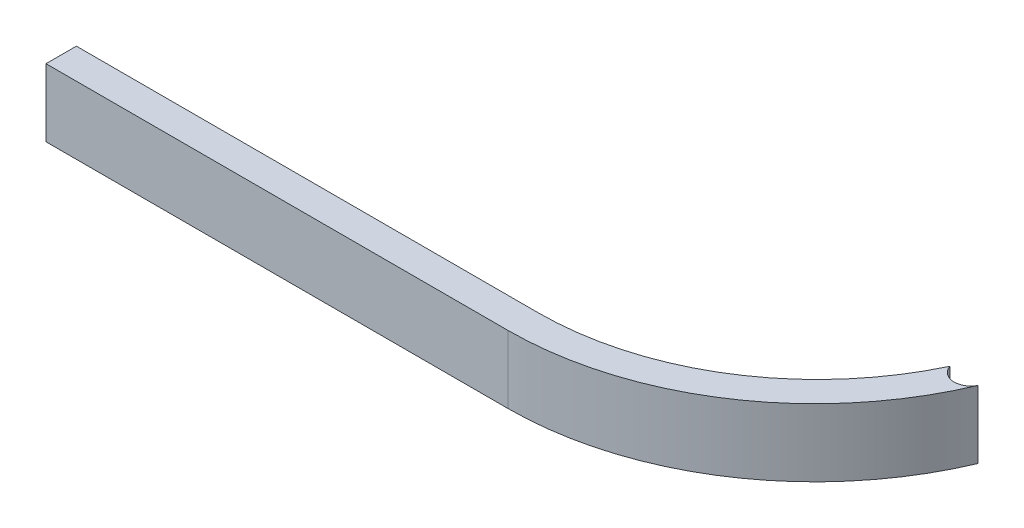
ISO-10303-21;
HEADER;
FILE_DESCRIPTION(('STEP AP214'),'2;1');
FILE_NAME('part.step','',(''),(''),'','','');
FILE_SCHEMA(('AUTOMOTIVE_DESIGN { 1 0 10303 214 1 1 1 1 }'));
ENDSEC;
DATA;
#1=APPLICATION_CONTEXT('core data for automotive mechanical design processes');
#2=APPLICATION_PROTOCOL_DEFINITION('international standard','automotive_design',2000,#1);
#3=PRODUCT_CONTEXT('',#1,'mechanical');
#4=PRODUCT('Part','Part','',(#3));
#5=PRODUCT_RELATED_PRODUCT_CATEGORY('part','',(#4));
#6=PRODUCT_DEFINITION_FORMATION('','',#4);
#7=PRODUCT_DEFINITION_CONTEXT('part definition',#1,'design');
#8=PRODUCT_DEFINITION('design','',#6,#7);
#9=PRODUCT_DEFINITION_SHAPE('','',#8);
#10=(LENGTH_UNIT() NAMED_UNIT(*) SI_UNIT(.MILLI.,.METRE.));
#11=(NAMED_UNIT(*) PLANE_ANGLE_UNIT() SI_UNIT($,.RADIAN.));
#12=(NAMED_UNIT(*) SI_UNIT($,.STERADIAN.) SOLID_ANGLE_UNIT());
#13=UNCERTAINTY_MEASURE_WITH_UNIT(LENGTH_MEASURE(1.E-05),#10,'distance_accuracy_value','');
#14=(GEOMETRIC_REPRESENTATION_CONTEXT(3) GLOBAL_UNCERTAINTY_ASSIGNED_CONTEXT((#13)) GLOBAL_UNIT_ASSIGNED_CONTEXT((#10,
#11,#12)) REPRESENTATION_CONTEXT('',''));
#15=CARTESIAN_POINT('',(0.,0.,0.));
#16=DIRECTION('',(0.,0.,1.));
#17=DIRECTION('',(1.,0.,0.));
#18=AXIS2_PLACEMENT_3D('',#15,#16,#17);
#19=CARTESIAN_POINT('',(54.4249201798668,10.,-17.261267056428));
#20=DIRECTION('',(0.,-1.,0.));
#21=DIRECTION('',(0.,0.,-1.));
#22=AXIS2_PLACEMENT_3D('',#19,#20,#21);
#23=CYLINDRICAL_SURFACE('',#22,2.4613600877615);
#24=CARTESIAN_POINT('',(54.4249201798668,0.,-17.261267056428));
#25=DIRECTION('',(0.,1.,0.));
#26=DIRECTION('',(0.,0.,1.));
#27=AXIS2_PLACEMENT_3D('',#24,#25,#26);
#28=CIRCLE('',#27,2.4613600877615);
#29=CARTESIAN_POINT('',(52.084,0.,-16.50075));
#30=VERTEX_POINT('',#29);
#31=CARTESIAN_POINT('',(56.6104431919356,0.,-16.1291086552565));
#32=VERTEX_POINT('',#31);
#33=EDGE_CURVE('E115',#30,#32,#28,.T.);
#34=ORIENTED_EDGE('',*,*,#33,.F.);
#35=DIRECTION('',(0.,-1.,0.));
#36=VECTOR('',#35,1.);
#37=CARTESIAN_POINT('',(52.084,10.,-16.50075));
#38=LINE('',#37,#36);
#39=CARTESIAN_POINT('',(52.084,10.,-16.50075));
#40=VERTEX_POINT('',#39);
#41=EDGE_CURVE('E11',#40,#30,#38,.T.);
#42=ORIENTED_EDGE('',*,*,#41,.F.);
#43=CARTESIAN_POINT('',(54.4249201798668,10.,-17.261267056428));
#44=DIRECTION('',(0.,1.,0.));
#45=DIRECTION('',(0.,0.,1.));
#46=AXIS2_PLACEMENT_3D('',#43,#44,#45);
#47=CIRCLE('',#46,2.4613600877615);
#48=CARTESIAN_POINT('',(56.6104431919356,10.,-16.1291086552565));
#49=VERTEX_POINT('',#48);
#50=EDGE_CURVE('E128',#40,#49,#47,.T.);
#51=ORIENTED_EDGE('',*,*,#50,.T.);
#52=DIRECTION('',(0.,-1.,0.));
#53=VECTOR('',#52,1.);
#54=CARTESIAN_POINT('',(56.6104431919356,10.,-16.1291086552565));
#55=LINE('',#54,#53);
#56=EDGE_CURVE('E80',#49,#32,#55,.T.);
#57=ORIENTED_EDGE('',*,*,#56,.T.);
#58=EDGE_LOOP('',(#34,#42,#51,#57));
#59=FACE_BOUND('',#58,.T.);
#60=ADVANCED_FACE('F35',(#59),#23,.F.);
#61=CARTESIAN_POINT('',(14.8170000000005,10.,-34.1731761904755));
#62=DIRECTION('',(0.,-1.,0.));
#63=DIRECTION('',(0.,0.,-1.));
#64=AXIS2_PLACEMENT_3D('',#61,#62,#63);
#65=CYLINDRICAL_SURFACE('',#64,41.2449261904755);
#66=CARTESIAN_POINT('',(14.8170000000005,0.,-34.1731761904755));
#67=DIRECTION('',(0.,1.,0.));
#68=DIRECTION('',(0.,0.,1.));
#69=AXIS2_PLACEMENT_3D('',#66,#67,#68);
#70=CIRCLE('',#69,41.2449261904755);
#71=CARTESIAN_POINT('',(14.8170000000005,0.,7.07174999999999));
#72=VERTEX_POINT('',#71);
#73=EDGE_CURVE('E118',#72,#30,#70,.T.);
#74=ORIENTED_EDGE('',*,*,#73,.F.);
#75=DIRECTION('',(0.,-1.,0.));
#76=VECTOR('',#75,1.);
#77=CARTESIAN_POINT('',(14.8170000000005,10.,7.07174999999999));
#78=LINE('',#77,#76);
#79=CARTESIAN_POINT('',(14.8170000000005,10.,7.07174999999999));
#80=VERTEX_POINT('',#79);
#81=EDGE_CURVE('E43',#80,#72,#78,.T.);
#82=ORIENTED_EDGE('',*,*,#81,.F.);
#83=CARTESIAN_POINT('',(14.8170000000005,10.,-34.1731761904755));
#84=DIRECTION('',(0.,1.,0.));
#85=DIRECTION('',(0.,0.,1.));
#86=AXIS2_PLACEMENT_3D('',#83,#84,#85);
#87=CIRCLE('',#86,41.2449261904755);
#88=EDGE_CURVE('E143',#80,#40,#87,.T.);
#89=ORIENTED_EDGE('',*,*,#88,.T.);
#90=ORIENTED_EDGE('',*,*,#41,.T.);
#91=EDGE_LOOP('',(#74,#82,#89,#90));
#92=FACE_BOUND('',#91,.T.);
#93=ADVANCED_FACE('F137',(#92),#65,.F.);
#94=CARTESIAN_POINT('',(0.,10.,7.07174999999999));
#95=DIRECTION('',(0.,0.,-1.));
#96=DIRECTION('',(-1.,0.,0.));
#97=AXIS2_PLACEMENT_3D('',#94,#95,#96);
#98=PLANE('',#97);
#99=DIRECTION('',(1.,0.,0.));
#100=VECTOR('',#99,1.);
#101=CARTESIAN_POINT('',(0.,0.,7.07174999999999));
#102=LINE('',#101,#100);
#103=CARTESIAN_POINT('',(-53.431,0.,7.07174999999999));
#104=VERTEX_POINT('',#103);
#105=EDGE_CURVE('E121',#104,#72,#102,.T.);
#106=ORIENTED_EDGE('',*,*,#105,.F.);
#107=DIRECTION('',(0.,-1.,0.));
#108=VECTOR('',#107,1.);
#109=CARTESIAN_POINT('',(-53.431,10.,7.07174999999999));
#110=LINE('',#109,#108);
#111=CARTESIAN_POINT('',(-53.431,10.,7.07174999999999));
#112=VERTEX_POINT('',#111);
#113=EDGE_CURVE('E107',#112,#104,#110,.T.);
#114=ORIENTED_EDGE('',*,*,#113,.F.);
#115=DIRECTION('',(1.,0.,0.));
#116=VECTOR('',#115,1.);
#117=CARTESIAN_POINT('',(0.,10.,7.07174999999999));
#118=LINE('',#117,#116);
#119=EDGE_CURVE('E100',#112,#80,#118,.T.);
#120=ORIENTED_EDGE('',*,*,#119,.T.);
#121=ORIENTED_EDGE('',*,*,#81,.T.);
#122=EDGE_LOOP('',(#106,#114,#120,#121));
#123=FACE_BOUND('',#122,.T.);
#124=ADVANCED_FACE('F134',(#123),#98,.T.);
#125=CARTESIAN_POINT('',(-53.431,10.,0.));
#126=DIRECTION('',(1.,0.,0.));
#127=DIRECTION('',(0.,0.,-1.));
#128=AXIS2_PLACEMENT_3D('',#125,#126,#127);
#129=PLANE('',#128);
#130=DIRECTION('',(0.,0.,1.));
#131=VECTOR('',#130,1.);
#132=CARTESIAN_POINT('',(-53.431,0.,0.));
#133=LINE('',#132,#131);
#134=CARTESIAN_POINT('',(-53.431,0.,11.56175));
#135=VERTEX_POINT('',#134);
#136=EDGE_CURVE('E106',#104,#135,#133,.T.);
#137=ORIENTED_EDGE('',*,*,#136,.T.);
#138=DIRECTION('',(0.,-1.,0.));
#139=VECTOR('',#138,1.);
#140=CARTESIAN_POINT('',(-53.431,10.,11.56175));
#141=LINE('',#140,#139);
#142=CARTESIAN_POINT('',(-53.431,10.,11.56175));
#143=VERTEX_POINT('',#142);
#144=EDGE_CURVE('E103',#143,#135,#141,.T.);
#145=ORIENTED_EDGE('',*,*,#144,.F.);
#146=DIRECTION('',(0.,0.,1.));
#147=VECTOR('',#146,1.);
#148=CARTESIAN_POINT('',(-53.431,10.,0.));
#149=LINE('',#148,#147);
#150=EDGE_CURVE('E93',#112,#143,#149,.T.);
#151=ORIENTED_EDGE('',*,*,#150,.F.);
#152=ORIENTED_EDGE('',*,*,#113,.T.);
#153=EDGE_LOOP('',(#137,#145,#151,#152));
#154=FACE_BOUND('',#153,.T.);
#155=ADVANCED_FACE('F104',(#154),#129,.F.);
#156=CARTESIAN_POINT('',(0.,10.,11.56175));
#157=DIRECTION('',(0.,0.,-1.));
#158=DIRECTION('',(-1.,0.,0.));
#159=AXIS2_PLACEMENT_3D('',#156,#157,#158);
#160=PLANE('',#159);
#161=DIRECTION('',(1.,0.,0.));
#162=VECTOR('',#161,1.);
#163=CARTESIAN_POINT('',(0.,0.,11.56175));
#164=LINE('',#163,#162);
#165=CARTESIAN_POINT('',(14.817,0.,11.56175));
#166=VERTEX_POINT('',#165);
#167=EDGE_CURVE('E73',#135,#166,#164,.T.);
#168=ORIENTED_EDGE('',*,*,#167,.T.);
#169=DIRECTION('',(0.,-1.,0.));
#170=VECTOR('',#169,1.);
#171=CARTESIAN_POINT('',(14.817,10.,11.56175));
#172=LINE('',#171,#170);
#173=CARTESIAN_POINT('',(14.817,10.,11.56175));
#174=VERTEX_POINT('',#173);
#175=EDGE_CURVE('E108',#174,#166,#172,.T.);
#176=ORIENTED_EDGE('',*,*,#175,.F.);
#177=DIRECTION('',(1.,0.,0.));
#178=VECTOR('',#177,1.);
#179=CARTESIAN_POINT('',(0.,10.,11.56175));
#180=LINE('',#179,#178);
#181=EDGE_CURVE('E97',#143,#174,#180,.T.);
#182=ORIENTED_EDGE('',*,*,#181,.F.);
#183=ORIENTED_EDGE('',*,*,#144,.T.);
#184=EDGE_LOOP('',(#168,#176,#182,#183));
#185=FACE_BOUND('',#184,.T.);
#186=ADVANCED_FACE('F110',(#185),#160,.F.);
#187=CARTESIAN_POINT('',(14.817,10.,-33.8228221830986));
#188=DIRECTION('',(0.,-1.,0.));
#189=DIRECTION('',(0.,0.,-1.));
#190=AXIS2_PLACEMENT_3D('',#187,#188,#189);
#191=CYLINDRICAL_SURFACE('',#190,45.3845721830986);
#192=CARTESIAN_POINT('',(14.817,0.,-33.8228221830986));
#193=DIRECTION('',(0.,1.,0.));
#194=DIRECTION('',(0.,0.,1.));
#195=AXIS2_PLACEMENT_3D('',#192,#193,#194);
#196=CIRCLE('',#195,45.3845721830986);
#197=EDGE_CURVE('E126',#166,#32,#196,.T.);
#198=ORIENTED_EDGE('',*,*,#197,.T.);
#199=ORIENTED_EDGE('',*,*,#56,.F.);
#200=CARTESIAN_POINT('',(14.817,10.,-33.8228221830986));
#201=DIRECTION('',(0.,1.,0.));
#202=DIRECTION('',(0.,0.,1.));
#203=AXIS2_PLACEMENT_3D('',#200,#201,#202);
#204=CIRCLE('',#203,45.3845721830986);
#205=EDGE_CURVE('E51',#174,#49,#204,.T.);
#206=ORIENTED_EDGE('',*,*,#205,.F.);
#207=ORIENTED_EDGE('',*,*,#175,.T.);
#208=EDGE_LOOP('',(#198,#199,#206,#207));
#209=FACE_BOUND('',#208,.T.);
#210=ADVANCED_FACE('F142',(#209),#191,.T.);
#211=CARTESIAN_POINT('',(0.,10.,0.));
#212=DIRECTION('',(0.,1.,0.));
#213=DIRECTION('',(0.,0.,1.));
#214=AXIS2_PLACEMENT_3D('',#211,#212,#213);
#215=PLANE('',#214);
#216=ORIENTED_EDGE('',*,*,#50,.F.);
#217=ORIENTED_EDGE('',*,*,#88,.F.);
#218=ORIENTED_EDGE('',*,*,#119,.F.);
#219=ORIENTED_EDGE('',*,*,#150,.T.);
#220=ORIENTED_EDGE('',*,*,#181,.T.);
#221=ORIENTED_EDGE('',*,*,#205,.T.);
#222=EDGE_LOOP('',(#216,#217,#218,#219,#220,#221));
#223=FACE_BOUND('',#222,.T.);
#224=ADVANCED_FACE('F95',(#223),#215,.T.);
#225=CARTESIAN_POINT('',(0.,0.,0.));
#226=DIRECTION('',(0.,1.,0.));
#227=DIRECTION('',(0.,0.,1.));
#228=AXIS2_PLACEMENT_3D('',#225,#226,#227);
#229=PLANE('',#228);
#230=ORIENTED_EDGE('',*,*,#33,.T.);
#231=ORIENTED_EDGE('',*,*,#197,.F.);
#232=ORIENTED_EDGE('',*,*,#167,.F.);
#233=ORIENTED_EDGE('',*,*,#136,.F.);
#234=ORIENTED_EDGE('',*,*,#105,.T.);
#235=ORIENTED_EDGE('',*,*,#73,.T.);
#236=EDGE_LOOP('',(#230,#231,#232,#233,#234,#235));
#237=FACE_BOUND('',#236,.T.);
#238=ADVANCED_FACE('F139',(#237),#229,.F.);
#239=CLOSED_SHELL('',(#60,#93,#124,#155,#186,#210,#224,#238));
#240=MANIFOLD_SOLID_BREP('B2',#239);
#241=ADVANCED_BREP_SHAPE_REPRESENTATION('',(#18,#240),#14);
#242=SHAPE_DEFINITION_REPRESENTATION(#9,#241);
ENDSEC;
END-ISO-10303-21;
